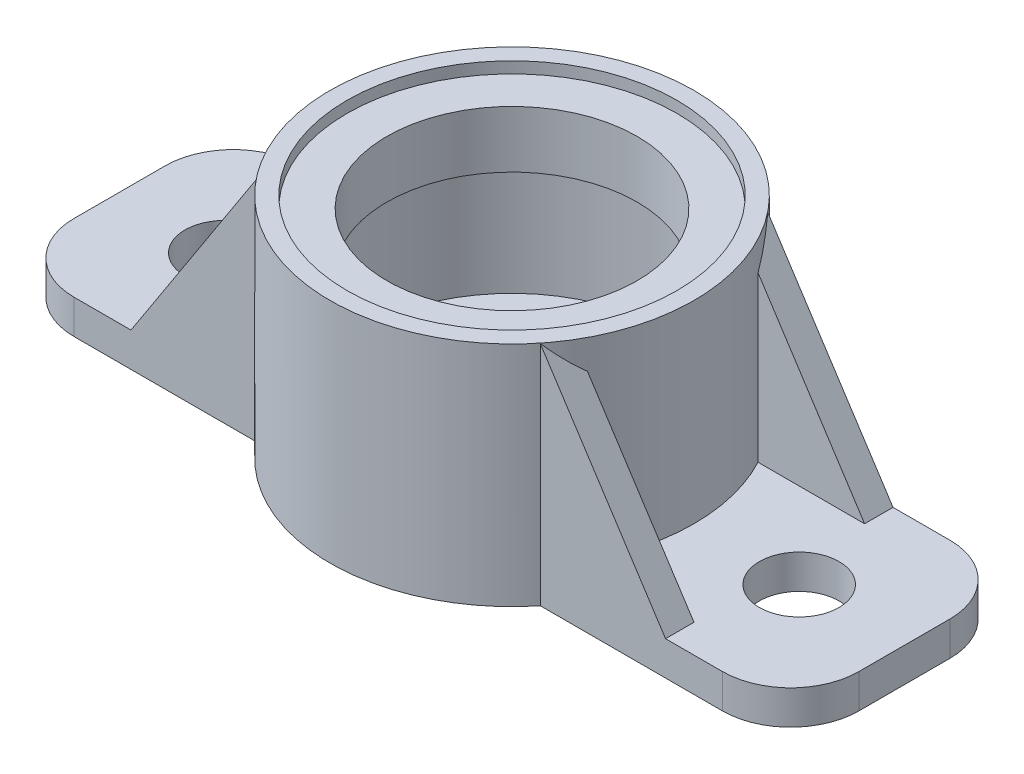
ISO-10303-21;
HEADER;
FILE_DESCRIPTION(('STEP AP214'),'2;1');
FILE_NAME('part.step','',(''),(''),'','','');
FILE_SCHEMA(('AUTOMOTIVE_DESIGN { 1 0 10303 214 1 1 1 1 }'));
ENDSEC;
DATA;
#1=APPLICATION_CONTEXT('core data for automotive mechanical design processes');
#2=APPLICATION_PROTOCOL_DEFINITION('international standard','automotive_design',2000,#1);
#3=PRODUCT_CONTEXT('',#1,'mechanical');
#4=PRODUCT('Part','Part','',(#3));
#5=PRODUCT_RELATED_PRODUCT_CATEGORY('part','',(#4));
#6=PRODUCT_DEFINITION_FORMATION('','',#4);
#7=PRODUCT_DEFINITION_CONTEXT('part definition',#1,'design');
#8=PRODUCT_DEFINITION('design','',#6,#7);
#9=PRODUCT_DEFINITION_SHAPE('','',#8);
#10=(LENGTH_UNIT() NAMED_UNIT(*) SI_UNIT(.MILLI.,.METRE.));
#11=(NAMED_UNIT(*) PLANE_ANGLE_UNIT() SI_UNIT($,.RADIAN.));
#12=(NAMED_UNIT(*) SI_UNIT($,.STERADIAN.) SOLID_ANGLE_UNIT());
#13=UNCERTAINTY_MEASURE_WITH_UNIT(LENGTH_MEASURE(1.E-05),#10,'distance_accuracy_value','');
#14=(GEOMETRIC_REPRESENTATION_CONTEXT(3) GLOBAL_UNCERTAINTY_ASSIGNED_CONTEXT((#13)) GLOBAL_UNIT_ASSIGNED_CONTEXT((#10,
#11,#12)) REPRESENTATION_CONTEXT('',''));
#15=CARTESIAN_POINT('',(0.,0.,0.));
#16=DIRECTION('',(0.,0.,1.));
#17=DIRECTION('',(1.,0.,0.));
#18=AXIS2_PLACEMENT_3D('',#15,#16,#17);
#19=CARTESIAN_POINT('',(0.,15.24,50.8));
#20=DIRECTION('',(0.,0.,-1.));
#21=DIRECTION('',(-1.,0.,0.));
#22=AXIS2_PLACEMENT_3D('',#19,#20,#21);
#23=PLANE('',#22);
#24=DIRECTION('',(1.,0.,0.));
#25=VECTOR('',#24,1.);
#26=CARTESIAN_POINT('',(0.,0.,50.8));
#27=LINE('',#26,#25);
#28=CARTESIAN_POINT('',(63.4491796637277,0.,50.8));
#29=VERTEX_POINT('',#28);
#30=CARTESIAN_POINT('',(144.78,0.,50.8));
#31=VERTEX_POINT('',#30);
#32=EDGE_CURVE('E335',#29,#31,#27,.T.);
#33=ORIENTED_EDGE('',*,*,#32,.T.);
#34=DIRECTION('',(0.,-1.,0.));
#35=VECTOR('',#34,1.);
#36=CARTESIAN_POINT('',(144.78,15.24,50.8));
#37=LINE('',#36,#35);
#38=CARTESIAN_POINT('',(144.78,15.24,50.8));
#39=VERTEX_POINT('',#38);
#40=EDGE_CURVE('E11',#31,#39,#37,.F.);
#41=ORIENTED_EDGE('',*,*,#40,.T.);
#42=DIRECTION('',(1.,0.,0.));
#43=VECTOR('',#42,1.);
#44=CARTESIAN_POINT('',(0.,15.24,50.8));
#45=LINE('',#44,#43);
#46=CARTESIAN_POINT('',(119.38,15.24,50.8));
#47=VERTEX_POINT('',#46);
#48=EDGE_CURVE('E342',#47,#39,#45,.T.);
#49=ORIENTED_EDGE('',*,*,#48,.F.);
#50=DIRECTION('',(-0.544639035015031,0.838670567945421,0.));
#51=VECTOR('',#50,1.);
#52=CARTESIAN_POINT('',(83.968110225194,69.7695283666871,50.8));
#53=LINE('',#52,#51);
#54=CARTESIAN_POINT('',(63.4491796637277,101.365910633233,50.8));
#55=VERTEX_POINT('',#54);
#56=EDGE_CURVE('E217',#47,#55,#53,.T.);
#57=ORIENTED_EDGE('',*,*,#56,.T.);
#58=DIRECTION('',(0.,-1.,0.));
#59=VECTOR('',#58,1.);
#60=CARTESIAN_POINT('',(63.4491796637277,0.,50.8));
#61=LINE('',#60,#59);
#62=EDGE_CURVE('E327',#55,#29,#61,.T.);
#63=ORIENTED_EDGE('',*,*,#62,.T.);
#64=EDGE_LOOP('',(#33,#41,#49,#57,#63));
#65=FACE_BOUND('',#64,.T.);
#66=ADVANCED_FACE('F41',(#65),#23,.F.);
#67=CARTESIAN_POINT('',(0.,15.24,-50.8));
#68=DIRECTION('',(0.,0.,-1.));
#69=DIRECTION('',(-1.,0.,0.));
#70=AXIS2_PLACEMENT_3D('',#67,#68,#69);
#71=PLANE('',#70);
#72=DIRECTION('',(1.,0.,0.));
#73=VECTOR('',#72,1.);
#74=CARTESIAN_POINT('',(0.,15.24,-50.8));
#75=LINE('',#74,#73);
#76=CARTESIAN_POINT('',(119.38,15.24,-50.8));
#77=VERTEX_POINT('',#76);
#78=CARTESIAN_POINT('',(144.78,15.24,-50.8));
#79=VERTEX_POINT('',#78);
#80=EDGE_CURVE('E345',#77,#79,#75,.T.);
#81=ORIENTED_EDGE('',*,*,#80,.T.);
#82=DIRECTION('',(0.,-1.,0.));
#83=VECTOR('',#82,1.);
#84=CARTESIAN_POINT('',(144.78,0.,-50.8));
#85=LINE('',#84,#83);
#86=CARTESIAN_POINT('',(144.78,0.,-50.8));
#87=VERTEX_POINT('',#86);
#88=EDGE_CURVE('E427',#79,#87,#85,.T.);
#89=ORIENTED_EDGE('',*,*,#88,.T.);
#90=DIRECTION('',(1.,0.,0.));
#91=VECTOR('',#90,1.);
#92=CARTESIAN_POINT('',(0.,0.,-50.8));
#93=LINE('',#92,#91);
#94=CARTESIAN_POINT('',(63.4491796637277,0.,-50.8));
#95=VERTEX_POINT('',#94);
#96=EDGE_CURVE('E372',#95,#87,#93,.T.);
#97=ORIENTED_EDGE('',*,*,#96,.F.);
#98=DIRECTION('',(0.,-1.,0.));
#99=VECTOR('',#98,1.);
#100=CARTESIAN_POINT('',(63.4491796637277,0.,-50.8));
#101=LINE('',#100,#99);
#102=CARTESIAN_POINT('',(63.4491796637277,101.365910633233,-50.8));
#103=VERTEX_POINT('',#102);
#104=EDGE_CURVE('E323',#103,#95,#101,.T.);
#105=ORIENTED_EDGE('',*,*,#104,.F.);
#106=DIRECTION('',(0.544639035015031,-0.838670567945421,0.));
#107=VECTOR('',#106,1.);
#108=CARTESIAN_POINT('',(83.968110225194,69.7695283666871,-50.8));
#109=LINE('',#108,#107);
#110=EDGE_CURVE('E263',#103,#77,#109,.T.);
#111=ORIENTED_EDGE('',*,*,#110,.T.);
#112=EDGE_LOOP('',(#81,#89,#97,#105,#111));
#113=FACE_BOUND('',#112,.T.);
#114=ADVANCED_FACE('F450',(#113),#71,.T.);
#115=CARTESIAN_POINT('',(0.,15.24,0.));
#116=DIRECTION('',(0.,1.,0.));
#117=DIRECTION('',(0.,0.,1.));
#118=AXIS2_PLACEMENT_3D('',#115,#116,#117);
#119=PLANE('',#118);
#120=DIRECTION('',(0.,0.,-1.));
#121=VECTOR('',#120,1.);
#122=CARTESIAN_POINT('',(175.26,15.24,0.));
#123=LINE('',#122,#121);
#124=CARTESIAN_POINT('',(175.26,15.24,20.32));
#125=VERTEX_POINT('',#124);
#126=CARTESIAN_POINT('',(175.26,15.24,-20.32));
#127=VERTEX_POINT('',#126);
#128=EDGE_CURVE('E341',#125,#127,#123,.T.);
#129=ORIENTED_EDGE('',*,*,#128,.T.);
#130=CARTESIAN_POINT('',(144.78,15.24,-20.32));
#131=DIRECTION('',(0.,1.,0.));
#132=DIRECTION('',(0.,0.,1.));
#133=AXIS2_PLACEMENT_3D('',#130,#131,#132);
#134=CIRCLE('',#133,30.48);
#135=EDGE_CURVE('E50',#127,#79,#134,.T.);
#136=ORIENTED_EDGE('',*,*,#135,.T.);
#137=ORIENTED_EDGE('',*,*,#80,.F.);
#138=DIRECTION('',(0.,0.,-1.));
#139=VECTOR('',#138,1.);
#140=CARTESIAN_POINT('',(119.38,15.24,-38.1));
#141=LINE('',#140,#139);
#142=CARTESIAN_POINT('',(119.38,15.24,-38.1));
#143=VERTEX_POINT('',#142);
#144=EDGE_CURVE('E271',#143,#77,#141,.T.);
#145=ORIENTED_EDGE('',*,*,#144,.F.);
#146=DIRECTION('',(-1.,0.,0.));
#147=VECTOR('',#146,1.);
#148=CARTESIAN_POINT('',(0.,15.24,-38.1));
#149=LINE('',#148,#147);
#150=CARTESIAN_POINT('',(71.7971336475211,15.24,-38.1));
#151=VERTEX_POINT('',#150);
#152=EDGE_CURVE('E267',#143,#151,#149,.T.);
#153=ORIENTED_EDGE('',*,*,#152,.T.);
#154=CARTESIAN_POINT('',(0.,15.24,0.));
#155=DIRECTION('',(0.,1.,0.));
#156=DIRECTION('',(0.,0.,1.));
#157=AXIS2_PLACEMENT_3D('',#154,#155,#156);
#158=CIRCLE('',#157,81.28);
#159=CARTESIAN_POINT('',(71.7971336475211,15.24,38.1));
#160=VERTEX_POINT('',#159);
#161=EDGE_CURVE('E317',#160,#151,#158,.T.);
#162=ORIENTED_EDGE('',*,*,#161,.F.);
#163=DIRECTION('',(1.,0.,0.));
#164=VECTOR('',#163,1.);
#165=CARTESIAN_POINT('',(0.,15.24,38.1));
#166=LINE('',#165,#164);
#167=CARTESIAN_POINT('',(119.38,15.24,38.1));
#168=VERTEX_POINT('',#167);
#169=EDGE_CURVE('E222',#160,#168,#166,.T.);
#170=ORIENTED_EDGE('',*,*,#169,.T.);
#171=DIRECTION('',(0.,0.,1.));
#172=VECTOR('',#171,1.);
#173=CARTESIAN_POINT('',(119.38,15.24,38.1));
#174=LINE('',#173,#172);
#175=EDGE_CURVE('E226',#168,#47,#174,.T.);
#176=ORIENTED_EDGE('',*,*,#175,.T.);
#177=ORIENTED_EDGE('',*,*,#48,.T.);
#178=CARTESIAN_POINT('',(144.78,15.24,20.32));
#179=DIRECTION('',(0.,1.,0.));
#180=DIRECTION('',(0.,0.,1.));
#181=AXIS2_PLACEMENT_3D('',#178,#179,#180);
#182=CIRCLE('',#181,30.48);
#183=EDGE_CURVE('E437',#39,#125,#182,.T.);
#184=ORIENTED_EDGE('',*,*,#183,.T.);
#185=EDGE_LOOP('',(#129,#136,#137,#145,#153,#162,#170,#176,#177,#184));
#186=FACE_BOUND('',#185,.T.);
#187=CARTESIAN_POINT('',(128.27,15.24,0.));
#188=DIRECTION('',(0.,1.,0.));
#189=DIRECTION('',(0.,0.,1.));
#190=AXIS2_PLACEMENT_3D('',#187,#188,#189);
#191=CIRCLE('',#190,17.78);
#192=CARTESIAN_POINT('',(128.27,15.24,17.78));
#193=VERTEX_POINT('',#192);
#194=EDGE_CURVE('E357',#193,#193,#191,.T.);
#195=ORIENTED_EDGE('',*,*,#194,.F.);
#196=EDGE_LOOP('',(#195));
#197=FACE_BOUND('',#196,.T.);
#198=ADVANCED_FACE('F444',(#186,#197),#119,.T.);
#199=CARTESIAN_POINT('',(-144.78,15.24,-50.8));
#200=VERTEX_POINT('',#199);
#201=CARTESIAN_POINT('',(-119.38,15.24,-50.8));
#202=VERTEX_POINT('',#201);
#203=EDGE_CURVE('E346',#200,#202,#75,.T.);
#204=ORIENTED_EDGE('',*,*,#203,.F.);
#205=CARTESIAN_POINT('',(-144.78,15.24,-20.32));
#206=DIRECTION('',(0.,1.,0.));
#207=DIRECTION('',(0.,0.,1.));
#208=AXIS2_PLACEMENT_3D('',#205,#206,#207);
#209=CIRCLE('',#208,30.48);
#210=CARTESIAN_POINT('',(-175.26,15.24,-20.32));
#211=VERTEX_POINT('',#210);
#212=EDGE_CURVE('E420',#200,#211,#209,.T.);
#213=ORIENTED_EDGE('',*,*,#212,.T.);
#214=DIRECTION('',(0.,0.,-1.));
#215=VECTOR('',#214,1.);
#216=CARTESIAN_POINT('',(-175.26,15.24,0.));
#217=LINE('',#216,#215);
#218=CARTESIAN_POINT('',(-175.26,15.24,20.32));
#219=VERTEX_POINT('',#218);
#220=EDGE_CURVE('E349',#219,#211,#217,.T.);
#221=ORIENTED_EDGE('',*,*,#220,.F.);
#222=CARTESIAN_POINT('',(-144.78,15.24,20.32));
#223=DIRECTION('',(0.,1.,0.));
#224=DIRECTION('',(0.,0.,1.));
#225=AXIS2_PLACEMENT_3D('',#222,#223,#224);
#226=CIRCLE('',#225,30.48);
#227=CARTESIAN_POINT('',(-144.78,15.24,50.8));
#228=VERTEX_POINT('',#227);
#229=EDGE_CURVE('E417',#219,#228,#226,.T.);
#230=ORIENTED_EDGE('',*,*,#229,.T.);
#231=CARTESIAN_POINT('',(-119.38,15.24,50.8));
#232=VERTEX_POINT('',#231);
#233=EDGE_CURVE('E207',#228,#232,#45,.T.);
#234=ORIENTED_EDGE('',*,*,#233,.T.);
#235=DIRECTION('',(0.,0.,1.));
#236=VECTOR('',#235,1.);
#237=CARTESIAN_POINT('',(-119.38,15.24,38.1));
#238=LINE('',#237,#236);
#239=CARTESIAN_POINT('',(-119.38,15.24,38.1));
#240=VERTEX_POINT('',#239);
#241=EDGE_CURVE('E186',#240,#232,#238,.T.);
#242=ORIENTED_EDGE('',*,*,#241,.F.);
#243=DIRECTION('',(1.,0.,0.));
#244=VECTOR('',#243,1.);
#245=CARTESIAN_POINT('',(0.,15.24,38.1));
#246=LINE('',#245,#244);
#247=CARTESIAN_POINT('',(-71.7971336475211,15.24,38.1));
#248=VERTEX_POINT('',#247);
#249=EDGE_CURVE('E192',#240,#248,#246,.T.);
#250=ORIENTED_EDGE('',*,*,#249,.T.);
#251=CARTESIAN_POINT('',(-71.7971336475211,15.24,-38.1));
#252=VERTEX_POINT('',#251);
#253=EDGE_CURVE('E313',#252,#248,#158,.T.);
#254=ORIENTED_EDGE('',*,*,#253,.F.);
#255=DIRECTION('',(-1.,0.,0.));
#256=VECTOR('',#255,1.);
#257=CARTESIAN_POINT('',(0.,15.24,-38.1));
#258=LINE('',#257,#256);
#259=CARTESIAN_POINT('',(-119.38,15.24,-38.1));
#260=VERTEX_POINT('',#259);
#261=EDGE_CURVE('E245',#252,#260,#258,.T.);
#262=ORIENTED_EDGE('',*,*,#261,.T.);
#263=DIRECTION('',(0.,0.,-1.));
#264=VECTOR('',#263,1.);
#265=CARTESIAN_POINT('',(-119.38,15.24,-38.1));
#266=LINE('',#265,#264);
#267=EDGE_CURVE('E249',#260,#202,#266,.T.);
#268=ORIENTED_EDGE('',*,*,#267,.T.);
#269=EDGE_LOOP('',(#204,#213,#221,#230,#234,#242,#250,#254,#262,#268));
#270=FACE_BOUND('',#269,.T.);
#271=CARTESIAN_POINT('',(-128.27,15.24,0.));
#272=DIRECTION('',(0.,1.,0.));
#273=DIRECTION('',(0.,0.,1.));
#274=AXIS2_PLACEMENT_3D('',#271,#272,#273);
#275=CIRCLE('',#274,17.78);
#276=CARTESIAN_POINT('',(-128.27,15.24,17.78));
#277=VERTEX_POINT('',#276);
#278=EDGE_CURVE('E361',#277,#277,#275,.F.);
#279=ORIENTED_EDGE('',*,*,#278,.T.);
#280=EDGE_LOOP('',(#279));
#281=FACE_BOUND('',#280,.T.);
#282=ADVANCED_FACE('F204',(#270,#281),#119,.T.);
#283=CARTESIAN_POINT('',(0.,15.24,0.));
#284=DIRECTION('',(0.,1.,0.));
#285=DIRECTION('',(0.,0.,1.));
#286=AXIS2_PLACEMENT_3D('',#283,#284,#285);
#287=CIRCLE('',#286,43.18);
#288=CARTESIAN_POINT('',(0.,15.24,43.18));
#289=VERTEX_POINT('',#288);
#290=EDGE_CURVE('E353',#289,#289,#287,.T.);
#291=ORIENTED_EDGE('',*,*,#290,.F.);
#292=EDGE_LOOP('',(#291));
#293=FACE_BOUND('',#292,.T.);
#294=CARTESIAN_POINT('',(0.,15.24,0.));
#295=DIRECTION('',(0.,1.,0.));
#296=DIRECTION('',(0.,0.,1.));
#297=AXIS2_PLACEMENT_3D('',#294,#295,#296);
#298=CIRCLE('',#297,68.58);
#299=CARTESIAN_POINT('',(0.,15.24,68.58));
#300=VERTEX_POINT('',#299);
#301=EDGE_CURVE('E391',#300,#300,#298,.F.);
#302=ORIENTED_EDGE('',*,*,#301,.F.);
#303=EDGE_LOOP('',(#302));
#304=FACE_BOUND('',#303,.T.);
#305=ADVANCED_FACE('F536',(#293,#304),#119,.T.);
#306=ORIENTED_EDGE('',*,*,#233,.F.);
#307=DIRECTION('',(0.,-1.,0.));
#308=VECTOR('',#307,1.);
#309=CARTESIAN_POINT('',(-144.78,0.,50.8));
#310=LINE('',#309,#308);
#311=CARTESIAN_POINT('',(-144.78,0.,50.8));
#312=VERTEX_POINT('',#311);
#313=EDGE_CURVE('E423',#228,#312,#310,.T.);
#314=ORIENTED_EDGE('',*,*,#313,.T.);
#315=CARTESIAN_POINT('',(-63.4491796637277,0.,50.8));
#316=VERTEX_POINT('',#315);
#317=EDGE_CURVE('E366',#312,#316,#27,.T.);
#318=ORIENTED_EDGE('',*,*,#317,.T.);
#319=DIRECTION('',(0.,-1.,0.));
#320=VECTOR('',#319,1.);
#321=CARTESIAN_POINT('',(-63.4491796637277,0.,50.8));
#322=LINE('',#321,#320);
#323=CARTESIAN_POINT('',(-63.4491796637277,101.365910633233,50.8));
#324=VERTEX_POINT('',#323);
#325=EDGE_CURVE('E320',#316,#324,#322,.F.);
#326=ORIENTED_EDGE('',*,*,#325,.T.);
#327=DIRECTION('',(-0.544639035015031,-0.838670567945421,0.));
#328=VECTOR('',#327,1.);
#329=CARTESIAN_POINT('',(-83.968110225194,69.7695283666871,50.8));
#330=LINE('',#329,#328);
#331=EDGE_CURVE('E193',#324,#232,#330,.T.);
#332=ORIENTED_EDGE('',*,*,#331,.T.);
#333=EDGE_LOOP('',(#306,#314,#318,#326,#332));
#334=FACE_BOUND('',#333,.T.);
#335=ADVANCED_FACE('F476',(#334),#23,.F.);
#336=CARTESIAN_POINT('',(175.26,15.24,0.));
#337=DIRECTION('',(-1.,0.,0.));
#338=DIRECTION('',(0.,0.,1.));
#339=AXIS2_PLACEMENT_3D('',#336,#337,#338);
#340=PLANE('',#339);
#341=DIRECTION('',(0.,0.,-1.));
#342=VECTOR('',#341,1.);
#343=CARTESIAN_POINT('',(175.26,0.,0.));
#344=LINE('',#343,#342);
#345=CARTESIAN_POINT('',(175.26,0.,20.32));
#346=VERTEX_POINT('',#345);
#347=CARTESIAN_POINT('',(175.26,0.,-20.32));
#348=VERTEX_POINT('',#347);
#349=EDGE_CURVE('E369',#346,#348,#344,.T.);
#350=ORIENTED_EDGE('',*,*,#349,.T.);
#351=DIRECTION('',(0.,-1.,0.));
#352=VECTOR('',#351,1.);
#353=CARTESIAN_POINT('',(175.26,15.24,-20.32));
#354=LINE('',#353,#352);
#355=EDGE_CURVE('E63',#348,#127,#354,.F.);
#356=ORIENTED_EDGE('',*,*,#355,.T.);
#357=ORIENTED_EDGE('',*,*,#128,.F.);
#358=DIRECTION('',(0.,-1.,0.));
#359=VECTOR('',#358,1.);
#360=CARTESIAN_POINT('',(175.26,15.24,20.32));
#361=LINE('',#360,#359);
#362=EDGE_CURVE('E431',#125,#346,#361,.T.);
#363=ORIENTED_EDGE('',*,*,#362,.T.);
#364=EDGE_LOOP('',(#350,#356,#357,#363));
#365=FACE_BOUND('',#364,.T.);
#366=ADVANCED_FACE('F459',(#365),#340,.F.);
#367=CARTESIAN_POINT('',(-144.78,0.,-50.8));
#368=VERTEX_POINT('',#367);
#369=CARTESIAN_POINT('',(-63.4491796637277,0.,-50.8));
#370=VERTEX_POINT('',#369);
#371=EDGE_CURVE('E373',#368,#370,#93,.T.);
#372=ORIENTED_EDGE('',*,*,#371,.F.);
#373=DIRECTION('',(0.,-1.,0.));
#374=VECTOR('',#373,1.);
#375=CARTESIAN_POINT('',(-144.78,15.24,-50.8));
#376=LINE('',#375,#374);
#377=EDGE_CURVE('E414',#368,#200,#376,.F.);
#378=ORIENTED_EDGE('',*,*,#377,.T.);
#379=ORIENTED_EDGE('',*,*,#203,.T.);
#380=DIRECTION('',(0.544639035015031,0.838670567945421,0.));
#381=VECTOR('',#380,1.);
#382=CARTESIAN_POINT('',(-83.968110225194,69.7695283666871,-50.8));
#383=LINE('',#382,#381);
#384=CARTESIAN_POINT('',(-63.4491796637277,101.365910633233,-50.8));
#385=VERTEX_POINT('',#384);
#386=EDGE_CURVE('E240',#202,#385,#383,.T.);
#387=ORIENTED_EDGE('',*,*,#386,.T.);
#388=DIRECTION('',(0.,-1.,0.));
#389=VECTOR('',#388,1.);
#390=CARTESIAN_POINT('',(-63.4491796637277,0.,-50.8));
#391=LINE('',#390,#389);
#392=EDGE_CURVE('E316',#370,#385,#391,.F.);
#393=ORIENTED_EDGE('',*,*,#392,.F.);
#394=EDGE_LOOP('',(#372,#378,#379,#387,#393));
#395=FACE_BOUND('',#394,.T.);
#396=ADVANCED_FACE('F495',(#395),#71,.T.);
#397=CARTESIAN_POINT('',(128.27,15.24,0.));
#398=DIRECTION('',(0.,-1.,0.));
#399=DIRECTION('',(0.,0.,-1.));
#400=AXIS2_PLACEMENT_3D('',#397,#398,#399);
#401=CYLINDRICAL_SURFACE('',#400,17.78);
#402=ORIENTED_EDGE('',*,*,#194,.T.);
#403=EDGE_LOOP('',(#402));
#404=FACE_BOUND('',#403,.T.);
#405=CARTESIAN_POINT('',(128.27,0.,0.));
#406=DIRECTION('',(0.,1.,0.));
#407=DIRECTION('',(0.,0.,1.));
#408=AXIS2_PLACEMENT_3D('',#405,#406,#407);
#409=CIRCLE('',#408,17.78);
#410=CARTESIAN_POINT('',(128.27,0.,17.78));
#411=VERTEX_POINT('',#410);
#412=EDGE_CURVE('E380',#411,#411,#409,.T.);
#413=ORIENTED_EDGE('',*,*,#412,.F.);
#414=EDGE_LOOP('',(#413));
#415=FACE_BOUND('',#414,.T.);
#416=ADVANCED_FACE('F583',(#404,#415),#401,.F.);
#417=CARTESIAN_POINT('',(0.,15.24,0.));
#418=DIRECTION('',(0.,-1.,0.));
#419=DIRECTION('',(0.,0.,-1.));
#420=AXIS2_PLACEMENT_3D('',#417,#418,#419);
#421=CYLINDRICAL_SURFACE('',#420,43.18);
#422=CARTESIAN_POINT('',(0.,10.16,0.));
#423=DIRECTION('',(0.,1.,0.));
#424=DIRECTION('',(0.,0.,1.));
#425=AXIS2_PLACEMENT_3D('',#422,#423,#424);
#426=CIRCLE('',#425,43.18);
#427=CARTESIAN_POINT('',(0.,10.16,43.18));
#428=VERTEX_POINT('',#427);
#429=EDGE_CURVE('E365',#428,#428,#426,.T.);
#430=ORIENTED_EDGE('',*,*,#429,.F.);
#431=EDGE_LOOP('',(#430));
#432=FACE_BOUND('',#431,.T.);
#433=ORIENTED_EDGE('',*,*,#290,.T.);
#434=EDGE_LOOP('',(#433));
#435=FACE_BOUND('',#434,.T.);
#436=ADVANCED_FACE('F595',(#432,#435),#421,.F.);
#437=CARTESIAN_POINT('',(-175.26,15.24,0.));
#438=DIRECTION('',(-1.,0.,0.));
#439=DIRECTION('',(0.,0.,1.));
#440=AXIS2_PLACEMENT_3D('',#437,#438,#439);
#441=PLANE('',#440);
#442=ORIENTED_EDGE('',*,*,#220,.T.);
#443=DIRECTION('',(0.,-1.,0.));
#444=VECTOR('',#443,1.);
#445=CARTESIAN_POINT('',(-175.26,15.24,-20.32));
#446=LINE('',#445,#444);
#447=CARTESIAN_POINT('',(-175.26,0.,-20.32));
#448=VERTEX_POINT('',#447);
#449=EDGE_CURVE('E398',#211,#448,#446,.T.);
#450=ORIENTED_EDGE('',*,*,#449,.T.);
#451=DIRECTION('',(0.,0.,-1.));
#452=VECTOR('',#451,1.);
#453=CARTESIAN_POINT('',(-175.26,0.,0.));
#454=LINE('',#453,#452);
#455=CARTESIAN_POINT('',(-175.26,0.,20.32));
#456=VERTEX_POINT('',#455);
#457=EDGE_CURVE('E376',#456,#448,#454,.T.);
#458=ORIENTED_EDGE('',*,*,#457,.F.);
#459=DIRECTION('',(0.,-1.,0.));
#460=VECTOR('',#459,1.);
#461=CARTESIAN_POINT('',(-175.26,15.24,20.32));
#462=LINE('',#461,#460);
#463=EDGE_CURVE('E395',#456,#219,#462,.F.);
#464=ORIENTED_EDGE('',*,*,#463,.T.);
#465=EDGE_LOOP('',(#442,#450,#458,#464));
#466=FACE_BOUND('',#465,.T.);
#467=ADVANCED_FACE('F485',(#466),#441,.T.);
#468=CARTESIAN_POINT('',(-128.27,15.24,0.));
#469=DIRECTION('',(0.,-1.,0.));
#470=DIRECTION('',(0.,0.,-1.));
#471=AXIS2_PLACEMENT_3D('',#468,#469,#470);
#472=CYLINDRICAL_SURFACE('',#471,17.78);
#473=ORIENTED_EDGE('',*,*,#278,.F.);
#474=EDGE_LOOP('',(#473));
#475=FACE_BOUND('',#474,.T.);
#476=CARTESIAN_POINT('',(-128.27,0.,0.));
#477=DIRECTION('',(0.,1.,0.));
#478=DIRECTION('',(0.,0.,1.));
#479=AXIS2_PLACEMENT_3D('',#476,#477,#478);
#480=CIRCLE('',#479,17.78);
#481=CARTESIAN_POINT('',(-128.27,0.,17.78));
#482=VERTEX_POINT('',#481);
#483=EDGE_CURVE('E384',#482,#482,#480,.F.);
#484=ORIENTED_EDGE('',*,*,#483,.T.);
#485=EDGE_LOOP('',(#484));
#486=FACE_BOUND('',#485,.T.);
#487=ADVANCED_FACE('F594',(#475,#486),#472,.F.);
#488=CARTESIAN_POINT('',(0.,0.,0.));
#489=DIRECTION('',(0.,1.,0.));
#490=DIRECTION('',(0.,0.,1.));
#491=AXIS2_PLACEMENT_3D('',#488,#489,#490);
#492=PLANE('',#491);
#493=ORIENTED_EDGE('',*,*,#457,.T.);
#494=CARTESIAN_POINT('',(-144.78,0.,-20.32));
#495=DIRECTION('',(0.,1.,0.));
#496=DIRECTION('',(0.,0.,1.));
#497=AXIS2_PLACEMENT_3D('',#494,#495,#496);
#498=CIRCLE('',#497,30.48);
#499=EDGE_CURVE('E411',#448,#368,#498,.F.);
#500=ORIENTED_EDGE('',*,*,#499,.T.);
#501=ORIENTED_EDGE('',*,*,#371,.T.);
#502=CARTESIAN_POINT('',(0.,0.,0.));
#503=DIRECTION('',(0.,-1.,0.));
#504=DIRECTION('',(0.,0.,-1.));
#505=AXIS2_PLACEMENT_3D('',#502,#503,#504);
#506=CIRCLE('',#505,81.28);
#507=EDGE_CURVE('E308',#370,#95,#506,.T.);
#508=ORIENTED_EDGE('',*,*,#507,.T.);
#509=ORIENTED_EDGE('',*,*,#96,.T.);
#510=CARTESIAN_POINT('',(144.78,0.,-20.32));
#511=DIRECTION('',(0.,1.,0.));
#512=DIRECTION('',(0.,0.,1.));
#513=AXIS2_PLACEMENT_3D('',#510,#511,#512);
#514=CIRCLE('',#513,30.48);
#515=EDGE_CURVE('E405',#87,#348,#514,.F.);
#516=ORIENTED_EDGE('',*,*,#515,.T.);
#517=ORIENTED_EDGE('',*,*,#349,.F.);
#518=CARTESIAN_POINT('',(144.78,0.,20.32));
#519=DIRECTION('',(0.,1.,0.));
#520=DIRECTION('',(0.,0.,1.));
#521=AXIS2_PLACEMENT_3D('',#518,#519,#520);
#522=CIRCLE('',#521,30.48);
#523=EDGE_CURVE('E402',#346,#31,#522,.F.);
#524=ORIENTED_EDGE('',*,*,#523,.T.);
#525=ORIENTED_EDGE('',*,*,#32,.F.);
#526=EDGE_CURVE('E312',#29,#316,#506,.T.);
#527=ORIENTED_EDGE('',*,*,#526,.T.);
#528=ORIENTED_EDGE('',*,*,#317,.F.);
#529=CARTESIAN_POINT('',(-144.78,0.,20.32));
#530=DIRECTION('',(0.,1.,0.));
#531=DIRECTION('',(0.,0.,1.));
#532=AXIS2_PLACEMENT_3D('',#529,#530,#531);
#533=CIRCLE('',#532,30.48);
#534=EDGE_CURVE('E408',#312,#456,#533,.F.);
#535=ORIENTED_EDGE('',*,*,#534,.T.);
#536=EDGE_LOOP('',(#493,#500,#501,#508,#509,#516,#517,#524,#525,#527,#528,#535));
#537=FACE_BOUND('',#536,.T.);
#538=ORIENTED_EDGE('',*,*,#483,.F.);
#539=EDGE_LOOP('',(#538));
#540=FACE_BOUND('',#539,.T.);
#541=ORIENTED_EDGE('',*,*,#412,.T.);
#542=EDGE_LOOP('',(#541));
#543=FACE_BOUND('',#542,.T.);
#544=CARTESIAN_POINT('',(0.,0.,0.));
#545=DIRECTION('',(0.,1.,0.));
#546=DIRECTION('',(0.,0.,1.));
#547=AXIS2_PLACEMENT_3D('',#544,#545,#546);
#548=CIRCLE('',#547,20.32);
#549=CARTESIAN_POINT('',(0.,0.,20.32));
#550=VERTEX_POINT('',#549);
#551=EDGE_CURVE('E330',#550,#550,#548,.T.);
#552=ORIENTED_EDGE('',*,*,#551,.T.);
#553=EDGE_LOOP('',(#552));
#554=FACE_BOUND('',#553,.T.);
#555=ADVANCED_FACE('F457',(#537,#540,#543,#554),#492,.F.);
#556=CARTESIAN_POINT('',(0.,10.16,0.));
#557=DIRECTION('',(0.,-1.,0.));
#558=DIRECTION('',(0.,0.,-1.));
#559=AXIS2_PLACEMENT_3D('',#556,#557,#558);
#560=CYLINDRICAL_SURFACE('',#559,20.32);
#561=CARTESIAN_POINT('',(0.,10.16,0.));
#562=DIRECTION('',(0.,1.,0.));
#563=DIRECTION('',(0.,0.,1.));
#564=AXIS2_PLACEMENT_3D('',#561,#562,#563);
#565=CIRCLE('',#564,20.32);
#566=CARTESIAN_POINT('',(0.,10.16,20.32));
#567=VERTEX_POINT('',#566);
#568=EDGE_CURVE('E331',#567,#567,#565,.T.);
#569=ORIENTED_EDGE('',*,*,#568,.T.);
#570=EDGE_LOOP('',(#569));
#571=FACE_BOUND('',#570,.T.);
#572=ORIENTED_EDGE('',*,*,#551,.F.);
#573=EDGE_LOOP('',(#572));
#574=FACE_BOUND('',#573,.T.);
#575=ADVANCED_FACE('F608',(#571,#574),#560,.F.);
#576=CARTESIAN_POINT('',(0.,10.16,0.));
#577=DIRECTION('',(0.,1.,0.));
#578=DIRECTION('',(0.,0.,1.));
#579=AXIS2_PLACEMENT_3D('',#576,#577,#578);
#580=PLANE('',#579);
#581=ORIENTED_EDGE('',*,*,#568,.F.);
#582=EDGE_LOOP('',(#581));
#583=FACE_BOUND('',#582,.T.);
#584=ORIENTED_EDGE('',*,*,#429,.T.);
#585=EDGE_LOOP('',(#584));
#586=FACE_BOUND('',#585,.T.);
#587=ADVANCED_FACE('F682',(#583,#586),#580,.T.);
#588=CARTESIAN_POINT('',(0.,0.,0.));
#589=DIRECTION('',(0.,-1.,0.));
#590=DIRECTION('',(0.,0.,-1.));
#591=AXIS2_PLACEMENT_3D('',#588,#589,#590);
#592=CYLINDRICAL_SURFACE('',#591,81.28);
#593=DIRECTION('',(0.,-1.,0.));
#594=VECTOR('',#593,1.);
#595=CARTESIAN_POINT('',(-71.7971336475211,0.,38.1));
#596=LINE('',#595,#594);
#597=CARTESIAN_POINT('',(-71.7971336475211,88.5111887740533,38.1));
#598=VERTEX_POINT('',#597);
#599=EDGE_CURVE('E197',#598,#248,#596,.T.);
#600=ORIENTED_EDGE('',*,*,#599,.F.);
#601=CARTESIAN_POINT('',(0.,199.069079380183,0.));
#602=DIRECTION('',(-0.838670567945421,0.544639035015031,0.));
#603=DIRECTION('',(-0.544639035015031,-0.838670567945421,0.));
#604=AXIS2_PLACEMENT_3D('',#601,#602,#603);
#605=ELLIPSE('',#604,149.236457129366,81.28);
#606=EDGE_CURVE('E188',#324,#598,#605,.F.);
#607=ORIENTED_EDGE('',*,*,#606,.F.);
#608=ORIENTED_EDGE('',*,*,#325,.F.);
#609=ORIENTED_EDGE('',*,*,#526,.F.);
#610=ORIENTED_EDGE('',*,*,#62,.F.);
#611=CARTESIAN_POINT('',(0.,199.069079380183,0.));
#612=DIRECTION('',(0.838670567945421,0.544639035015031,0.));
#613=DIRECTION('',(0.544639035015031,-0.838670567945421,0.));
#614=AXIS2_PLACEMENT_3D('',#611,#612,#613);
#615=ELLIPSE('',#614,149.236457129366,81.28);
#616=CARTESIAN_POINT('',(71.7971336475211,88.5111887740533,38.1));
#617=VERTEX_POINT('',#616);
#618=EDGE_CURVE('E236',#617,#55,#615,.F.);
#619=ORIENTED_EDGE('',*,*,#618,.F.);
#620=DIRECTION('',(0.,-1.,0.));
#621=VECTOR('',#620,1.);
#622=CARTESIAN_POINT('',(71.7971336475211,0.,38.1));
#623=LINE('',#622,#621);
#624=EDGE_CURVE('E233',#160,#617,#623,.F.);
#625=ORIENTED_EDGE('',*,*,#624,.F.);
#626=ORIENTED_EDGE('',*,*,#161,.T.);
#627=DIRECTION('',(0.,-1.,0.));
#628=VECTOR('',#627,1.);
#629=CARTESIAN_POINT('',(71.7971336475211,0.,-38.1));
#630=LINE('',#629,#628);
#631=CARTESIAN_POINT('',(71.7971336475211,88.5111887740533,-38.1));
#632=VERTEX_POINT('',#631);
#633=EDGE_CURVE('E277',#632,#151,#630,.T.);
#634=ORIENTED_EDGE('',*,*,#633,.F.);
#635=CARTESIAN_POINT('',(0.,199.069079380183,0.));
#636=DIRECTION('',(0.838670567945421,0.544639035015031,0.));
#637=DIRECTION('',(0.544639035015031,-0.838670567945421,0.));
#638=AXIS2_PLACEMENT_3D('',#635,#636,#637);
#639=ELLIPSE('',#638,149.236457129366,81.28);
#640=EDGE_CURVE('E281',#103,#632,#639,.F.);
#641=ORIENTED_EDGE('',*,*,#640,.F.);
#642=ORIENTED_EDGE('',*,*,#104,.T.);
#643=ORIENTED_EDGE('',*,*,#507,.F.);
#644=ORIENTED_EDGE('',*,*,#392,.T.);
#645=CARTESIAN_POINT('',(0.,199.069079380183,0.));
#646=DIRECTION('',(-0.838670567945421,0.544639035015031,0.));
#647=DIRECTION('',(-0.544639035015031,-0.838670567945421,0.));
#648=AXIS2_PLACEMENT_3D('',#645,#646,#647);
#649=ELLIPSE('',#648,149.236457129366,81.28);
#650=CARTESIAN_POINT('',(-71.7971336475211,88.5111887740533,-38.1));
#651=VERTEX_POINT('',#650);
#652=EDGE_CURVE('E259',#651,#385,#649,.F.);
#653=ORIENTED_EDGE('',*,*,#652,.F.);
#654=DIRECTION('',(0.,-1.,0.));
#655=VECTOR('',#654,1.);
#656=CARTESIAN_POINT('',(-71.7971336475211,0.,-38.1));
#657=LINE('',#656,#655);
#658=EDGE_CURVE('E256',#252,#651,#657,.F.);
#659=ORIENTED_EDGE('',*,*,#658,.F.);
#660=ORIENTED_EDGE('',*,*,#253,.T.);
#661=EDGE_LOOP('',(#600,#607,#608,#609,#610,#619,#625,#626,#634,#641,#642,#643,#644,#653,#659,#660));
#662=FACE_BOUND('',#661,.T.);
#663=CARTESIAN_POINT('',(0.,101.6,0.));
#664=DIRECTION('',(0.,-1.,0.));
#665=DIRECTION('',(0.,0.,-1.));
#666=AXIS2_PLACEMENT_3D('',#663,#664,#665);
#667=CIRCLE('',#666,81.28);
#668=CARTESIAN_POINT('',(0.,101.6,-81.28));
#669=VERTEX_POINT('',#668);
#670=EDGE_CURVE('E304',#669,#669,#667,.T.);
#671=ORIENTED_EDGE('',*,*,#670,.T.);
#672=EDGE_LOOP('',(#671));
#673=FACE_BOUND('',#672,.T.);
#674=ADVANCED_FACE('F472',(#662,#673),#592,.T.);
#675=CARTESIAN_POINT('',(0.,101.6,0.));
#676=DIRECTION('',(0.,1.,0.));
#677=DIRECTION('',(0.,0.,1.));
#678=AXIS2_PLACEMENT_3D('',#675,#676,#677);
#679=PLANE('',#678);
#680=CARTESIAN_POINT('',(0.,101.6,0.));
#681=DIRECTION('',(0.,-1.,0.));
#682=DIRECTION('',(0.,0.,-1.));
#683=AXIS2_PLACEMENT_3D('',#680,#681,#682);
#684=CIRCLE('',#683,73.66);
#685=CARTESIAN_POINT('',(0.,101.6,-73.66));
#686=VERTEX_POINT('',#685);
#687=EDGE_CURVE('E300',#686,#686,#684,.T.);
#688=ORIENTED_EDGE('',*,*,#687,.T.);
#689=EDGE_LOOP('',(#688));
#690=FACE_BOUND('',#689,.T.);
#691=ORIENTED_EDGE('',*,*,#670,.F.);
#692=EDGE_LOOP('',(#691));
#693=FACE_BOUND('',#692,.T.);
#694=ADVANCED_FACE('F666',(#690,#693),#679,.T.);
#695=CARTESIAN_POINT('',(0.,0.,0.));
#696=DIRECTION('',(0.,-1.,0.));
#697=DIRECTION('',(0.,0.,-1.));
#698=AXIS2_PLACEMENT_3D('',#695,#696,#697);
#699=CYLINDRICAL_SURFACE('',#698,73.66);
#700=CARTESIAN_POINT('',(0.,96.52,0.));
#701=DIRECTION('',(0.,-1.,0.));
#702=DIRECTION('',(0.,0.,-1.));
#703=AXIS2_PLACEMENT_3D('',#700,#701,#702);
#704=CIRCLE('',#703,73.66);
#705=CARTESIAN_POINT('',(0.,96.52,-73.66));
#706=VERTEX_POINT('',#705);
#707=EDGE_CURVE('E296',#706,#706,#704,.T.);
#708=ORIENTED_EDGE('',*,*,#707,.T.);
#709=EDGE_LOOP('',(#708));
#710=FACE_BOUND('',#709,.T.);
#711=ORIENTED_EDGE('',*,*,#687,.F.);
#712=EDGE_LOOP('',(#711));
#713=FACE_BOUND('',#712,.T.);
#714=ADVANCED_FACE('F671',(#710,#713),#699,.F.);
#715=CARTESIAN_POINT('',(0.,96.52,0.));
#716=DIRECTION('',(0.,1.,0.));
#717=DIRECTION('',(0.,0.,1.));
#718=AXIS2_PLACEMENT_3D('',#715,#716,#717);
#719=PLANE('',#718);
#720=CARTESIAN_POINT('',(0.,96.52,0.));
#721=DIRECTION('',(0.,-1.,0.));
#722=DIRECTION('',(0.,0.,-1.));
#723=AXIS2_PLACEMENT_3D('',#720,#721,#722);
#724=CIRCLE('',#723,55.88);
#725=CARTESIAN_POINT('',(0.,96.52,-55.88));
#726=VERTEX_POINT('',#725);
#727=EDGE_CURVE('E292',#726,#726,#724,.T.);
#728=ORIENTED_EDGE('',*,*,#727,.T.);
#729=EDGE_LOOP('',(#728));
#730=FACE_BOUND('',#729,.T.);
#731=ORIENTED_EDGE('',*,*,#707,.F.);
#732=EDGE_LOOP('',(#731));
#733=FACE_BOUND('',#732,.T.);
#734=ADVANCED_FACE('F743',(#730,#733),#719,.T.);
#735=CARTESIAN_POINT('',(0.,0.,0.));
#736=DIRECTION('',(0.,-1.,0.));
#737=DIRECTION('',(0.,0.,-1.));
#738=AXIS2_PLACEMENT_3D('',#735,#736,#737);
#739=CYLINDRICAL_SURFACE('',#738,55.88);
#740=CARTESIAN_POINT('',(0.,71.12,0.));
#741=DIRECTION('',(0.,-1.,0.));
#742=DIRECTION('',(0.,0.,-1.));
#743=AXIS2_PLACEMENT_3D('',#740,#741,#742);
#744=CIRCLE('',#743,55.88);
#745=CARTESIAN_POINT('',(0.,71.12,-55.88));
#746=VERTEX_POINT('',#745);
#747=EDGE_CURVE('E288',#746,#746,#744,.T.);
#748=ORIENTED_EDGE('',*,*,#747,.T.);
#749=EDGE_LOOP('',(#748));
#750=FACE_BOUND('',#749,.T.);
#751=ORIENTED_EDGE('',*,*,#727,.F.);
#752=EDGE_LOOP('',(#751));
#753=FACE_BOUND('',#752,.T.);
#754=ADVANCED_FACE('F733',(#750,#753),#739,.F.);
#755=CARTESIAN_POINT('',(0.,71.12,0.));
#756=DIRECTION('',(0.,-1.,0.));
#757=DIRECTION('',(0.,0.,-1.));
#758=AXIS2_PLACEMENT_3D('',#755,#756,#757);
#759=PLANE('',#758);
#760=CARTESIAN_POINT('',(0.,71.12,0.));
#761=DIRECTION('',(0.,-1.,0.));
#762=DIRECTION('',(0.,0.,-1.));
#763=AXIS2_PLACEMENT_3D('',#760,#761,#762);
#764=CIRCLE('',#763,68.58);
#765=CARTESIAN_POINT('',(0.,71.12,-68.58));
#766=VERTEX_POINT('',#765);
#767=EDGE_CURVE('E284',#766,#766,#764,.T.);
#768=ORIENTED_EDGE('',*,*,#767,.T.);
#769=EDGE_LOOP('',(#768));
#770=FACE_BOUND('',#769,.T.);
#771=ORIENTED_EDGE('',*,*,#747,.F.);
#772=EDGE_LOOP('',(#771));
#773=FACE_BOUND('',#772,.T.);
#774=ADVANCED_FACE('F723',(#770,#773),#759,.T.);
#775=CARTESIAN_POINT('',(0.,0.,0.));
#776=DIRECTION('',(0.,-1.,0.));
#777=DIRECTION('',(0.,0.,-1.));
#778=AXIS2_PLACEMENT_3D('',#775,#776,#777);
#779=CYLINDRICAL_SURFACE('',#778,68.58);
#780=ORIENTED_EDGE('',*,*,#301,.T.);
#781=EDGE_LOOP('',(#780));
#782=FACE_BOUND('',#781,.T.);
#783=ORIENTED_EDGE('',*,*,#767,.F.);
#784=EDGE_LOOP('',(#783));
#785=FACE_BOUND('',#784,.T.);
#786=ADVANCED_FACE('F714',(#782,#785),#779,.F.);
#787=CARTESIAN_POINT('',(83.968110225194,69.7695283666871,-38.1));
#788=DIRECTION('',(0.838670567945421,0.544639035015031,0.));
#789=DIRECTION('',(-0.544639035015031,0.838670567945421,0.));
#790=AXIS2_PLACEMENT_3D('',#787,#788,#789);
#791=PLANE('',#790);
#792=ORIENTED_EDGE('',*,*,#110,.F.);
#793=ORIENTED_EDGE('',*,*,#640,.T.);
#794=DIRECTION('',(0.544639035015031,-0.838670567945421,0.));
#795=VECTOR('',#794,1.);
#796=CARTESIAN_POINT('',(83.968110225194,69.7695283666871,-38.1));
#797=LINE('',#796,#795);
#798=EDGE_CURVE('E264',#632,#143,#797,.T.);
#799=ORIENTED_EDGE('',*,*,#798,.T.);
#800=ORIENTED_EDGE('',*,*,#144,.T.);
#801=EDGE_LOOP('',(#792,#793,#799,#800));
#802=FACE_BOUND('',#801,.T.);
#803=ADVANCED_FACE('F502',(#802),#791,.T.);
#804=CARTESIAN_POINT('',(0.,0.,-38.1));
#805=DIRECTION('',(0.,0.,1.));
#806=DIRECTION('',(1.,0.,0.));
#807=AXIS2_PLACEMENT_3D('',#804,#805,#806);
#808=PLANE('',#807);
#809=ORIENTED_EDGE('',*,*,#798,.F.);
#810=ORIENTED_EDGE('',*,*,#633,.T.);
#811=ORIENTED_EDGE('',*,*,#152,.F.);
#812=EDGE_LOOP('',(#809,#810,#811));
#813=FACE_BOUND('',#812,.T.);
#814=ADVANCED_FACE('F507',(#813),#808,.T.);
#815=CARTESIAN_POINT('',(-83.968110225194,69.7695283666871,-38.1));
#816=DIRECTION('',(-0.838670567945421,0.544639035015031,0.));
#817=DIRECTION('',(-0.544639035015031,-0.838670567945421,0.));
#818=AXIS2_PLACEMENT_3D('',#815,#816,#817);
#819=PLANE('',#818);
#820=DIRECTION('',(0.544639035015031,0.838670567945421,0.));
#821=VECTOR('',#820,1.);
#822=CARTESIAN_POINT('',(-83.968110225194,69.7695283666871,-38.1));
#823=LINE('',#822,#821);
#824=EDGE_CURVE('E241',#260,#651,#823,.T.);
#825=ORIENTED_EDGE('',*,*,#824,.T.);
#826=ORIENTED_EDGE('',*,*,#652,.T.);
#827=ORIENTED_EDGE('',*,*,#386,.F.);
#828=ORIENTED_EDGE('',*,*,#267,.F.);
#829=EDGE_LOOP('',(#825,#826,#827,#828));
#830=FACE_BOUND('',#829,.T.);
#831=ADVANCED_FACE('F524',(#830),#819,.T.);
#832=CARTESIAN_POINT('',(0.,0.,-38.1));
#833=DIRECTION('',(0.,0.,1.));
#834=DIRECTION('',(1.,0.,0.));
#835=AXIS2_PLACEMENT_3D('',#832,#833,#834);
#836=PLANE('',#835);
#837=ORIENTED_EDGE('',*,*,#261,.F.);
#838=ORIENTED_EDGE('',*,*,#658,.T.);
#839=ORIENTED_EDGE('',*,*,#824,.F.);
#840=EDGE_LOOP('',(#837,#838,#839));
#841=FACE_BOUND('',#840,.T.);
#842=ADVANCED_FACE('F517',(#841),#836,.T.);
#843=CARTESIAN_POINT('',(83.968110225194,69.7695283666871,38.1));
#844=DIRECTION('',(0.838670567945421,0.544639035015031,0.));
#845=DIRECTION('',(-0.544639035015031,0.838670567945421,0.));
#846=AXIS2_PLACEMENT_3D('',#843,#844,#845);
#847=PLANE('',#846);
#848=DIRECTION('',(-0.544639035015031,0.838670567945421,0.));
#849=VECTOR('',#848,1.);
#850=CARTESIAN_POINT('',(83.968110225194,69.7695283666871,38.1));
#851=LINE('',#850,#849);
#852=EDGE_CURVE('E218',#168,#617,#851,.T.);
#853=ORIENTED_EDGE('',*,*,#852,.T.);
#854=ORIENTED_EDGE('',*,*,#618,.T.);
#855=ORIENTED_EDGE('',*,*,#56,.F.);
#856=ORIENTED_EDGE('',*,*,#175,.F.);
#857=EDGE_LOOP('',(#853,#854,#855,#856));
#858=FACE_BOUND('',#857,.T.);
#859=ADVANCED_FACE('F513',(#858),#847,.T.);
#860=CARTESIAN_POINT('',(0.,0.,38.1));
#861=DIRECTION('',(0.,0.,-1.));
#862=DIRECTION('',(-1.,0.,0.));
#863=AXIS2_PLACEMENT_3D('',#860,#861,#862);
#864=PLANE('',#863);
#865=ORIENTED_EDGE('',*,*,#169,.F.);
#866=ORIENTED_EDGE('',*,*,#624,.T.);
#867=ORIENTED_EDGE('',*,*,#852,.F.);
#868=EDGE_LOOP('',(#865,#866,#867));
#869=FACE_BOUND('',#868,.T.);
#870=ADVANCED_FACE('F511',(#869),#864,.T.);
#871=CARTESIAN_POINT('',(-83.968110225194,69.7695283666871,38.1));
#872=DIRECTION('',(-0.838670567945421,0.544639035015031,0.));
#873=DIRECTION('',(-0.544639035015031,-0.838670567945421,0.));
#874=AXIS2_PLACEMENT_3D('',#871,#872,#873);
#875=PLANE('',#874);
#876=ORIENTED_EDGE('',*,*,#331,.F.);
#877=ORIENTED_EDGE('',*,*,#606,.T.);
#878=DIRECTION('',(-0.544639035015031,-0.838670567945421,0.));
#879=VECTOR('',#878,1.);
#880=CARTESIAN_POINT('',(-83.968110225194,69.7695283666871,38.1));
#881=LINE('',#880,#879);
#882=EDGE_CURVE('E181',#598,#240,#881,.T.);
#883=ORIENTED_EDGE('',*,*,#882,.T.);
#884=ORIENTED_EDGE('',*,*,#241,.T.);
#885=EDGE_LOOP('',(#876,#877,#883,#884));
#886=FACE_BOUND('',#885,.T.);
#887=ADVANCED_FACE('F184',(#886),#875,.T.);
#888=CARTESIAN_POINT('',(0.,0.,38.1));
#889=DIRECTION('',(0.,0.,-1.));
#890=DIRECTION('',(-1.,0.,0.));
#891=AXIS2_PLACEMENT_3D('',#888,#889,#890);
#892=PLANE('',#891);
#893=ORIENTED_EDGE('',*,*,#882,.F.);
#894=ORIENTED_EDGE('',*,*,#599,.T.);
#895=ORIENTED_EDGE('',*,*,#249,.F.);
#896=EDGE_LOOP('',(#893,#894,#895));
#897=FACE_BOUND('',#896,.T.);
#898=ADVANCED_FACE('F196',(#897),#892,.T.);
#899=CARTESIAN_POINT('',(-144.78,15.24,-20.32));
#900=DIRECTION('',(0.,-1.,0.));
#901=DIRECTION('',(0.,0.,-1.));
#902=AXIS2_PLACEMENT_3D('',#899,#900,#901);
#903=CYLINDRICAL_SURFACE('',#902,30.48);
#904=ORIENTED_EDGE('',*,*,#212,.F.);
#905=ORIENTED_EDGE('',*,*,#377,.F.);
#906=ORIENTED_EDGE('',*,*,#499,.F.);
#907=ORIENTED_EDGE('',*,*,#449,.F.);
#908=EDGE_LOOP('',(#904,#905,#906,#907));
#909=FACE_BOUND('',#908,.T.);
#910=ADVANCED_FACE('F490',(#909),#903,.T.);
#911=CARTESIAN_POINT('',(-144.78,15.24,20.32));
#912=DIRECTION('',(0.,1.,0.));
#913=DIRECTION('',(0.,0.,1.));
#914=AXIS2_PLACEMENT_3D('',#911,#912,#913);
#915=CYLINDRICAL_SURFACE('',#914,30.48);
#916=ORIENTED_EDGE('',*,*,#229,.F.);
#917=ORIENTED_EDGE('',*,*,#463,.F.);
#918=ORIENTED_EDGE('',*,*,#534,.F.);
#919=ORIENTED_EDGE('',*,*,#313,.F.);
#920=EDGE_LOOP('',(#916,#917,#918,#919));
#921=FACE_BOUND('',#920,.T.);
#922=ADVANCED_FACE('F481',(#921),#915,.T.);
#923=CARTESIAN_POINT('',(144.78,15.24,-20.32));
#924=DIRECTION('',(0.,1.,0.));
#925=DIRECTION('',(0.,0.,1.));
#926=AXIS2_PLACEMENT_3D('',#923,#924,#925);
#927=CYLINDRICAL_SURFACE('',#926,30.48);
#928=ORIENTED_EDGE('',*,*,#135,.F.);
#929=ORIENTED_EDGE('',*,*,#355,.F.);
#930=ORIENTED_EDGE('',*,*,#515,.F.);
#931=ORIENTED_EDGE('',*,*,#88,.F.);
#932=EDGE_LOOP('',(#928,#929,#930,#931));
#933=FACE_BOUND('',#932,.T.);
#934=ADVANCED_FACE('F454',(#933),#927,.T.);
#935=CARTESIAN_POINT('',(144.78,15.24,20.32));
#936=DIRECTION('',(0.,-1.,0.));
#937=DIRECTION('',(0.,0.,-1.));
#938=AXIS2_PLACEMENT_3D('',#935,#936,#937);
#939=CYLINDRICAL_SURFACE('',#938,30.48);
#940=ORIENTED_EDGE('',*,*,#183,.F.);
#941=ORIENTED_EDGE('',*,*,#40,.F.);
#942=ORIENTED_EDGE('',*,*,#523,.F.);
#943=ORIENTED_EDGE('',*,*,#362,.F.);
#944=EDGE_LOOP('',(#940,#941,#942,#943));
#945=FACE_BOUND('',#944,.T.);
#946=ADVANCED_FACE('F43',(#945),#939,.T.);
#947=CLOSED_SHELL('',(#66,#114,#198,#282,#305,#335,#366,#396,#416,#436,#467,#487,#555,#575,#587,
#674,#694,#714,#734,#754,#774,#786,#803,#814,#831,#842,#859,#870,#887,#898,#910,#922,#934,#946));
#948=MANIFOLD_SOLID_BREP('B2',#947);
#949=ADVANCED_BREP_SHAPE_REPRESENTATION('',(#18,#948),#14);
#950=SHAPE_DEFINITION_REPRESENTATION(#9,#949);
ENDSEC;
END-ISO-10303-21;
